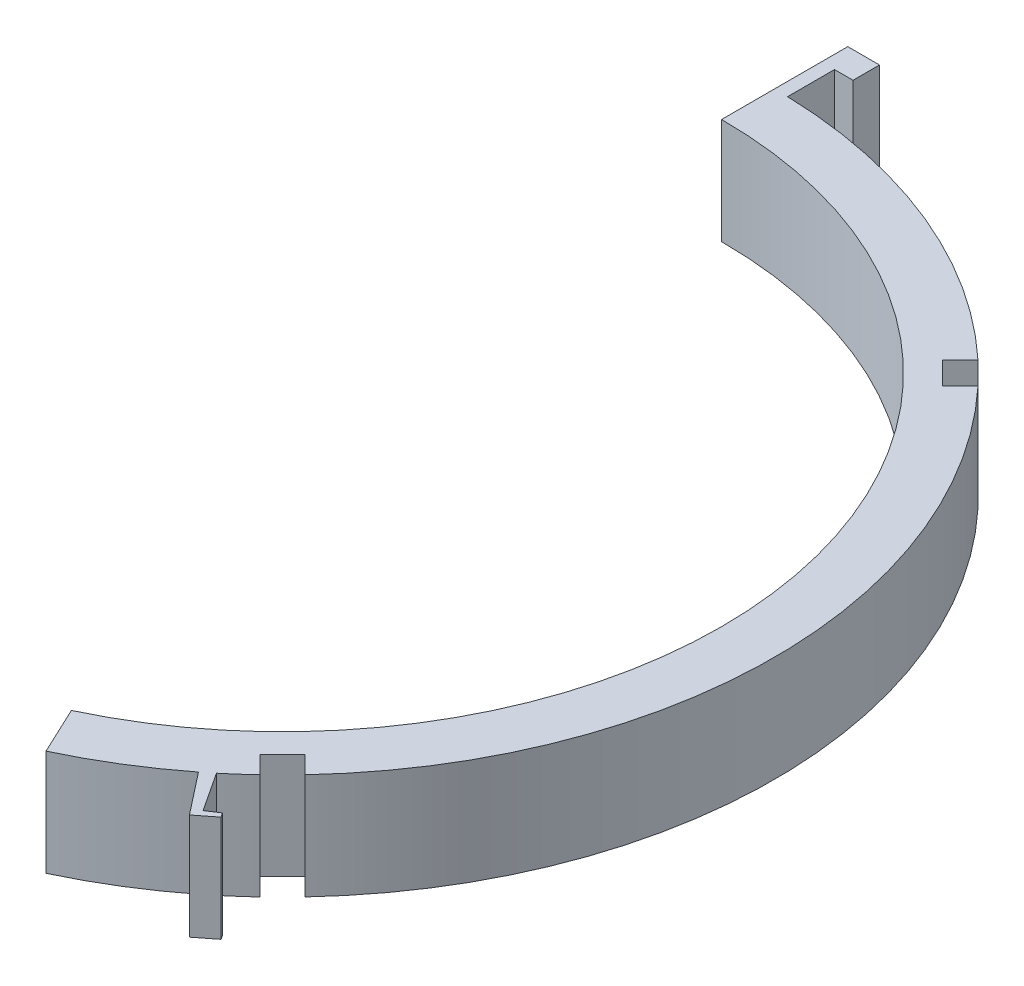
ISO-10303-21;
HEADER;
FILE_DESCRIPTION(('STEP AP214'),'2;1');
FILE_NAME('part.step','',(''),(''),'','','');
FILE_SCHEMA(('AUTOMOTIVE_DESIGN { 1 0 10303 214 1 1 1 1 }'));
ENDSEC;
DATA;
#1=APPLICATION_CONTEXT('core data for automotive mechanical design processes');
#2=APPLICATION_PROTOCOL_DEFINITION('international standard','automotive_design',2000,#1);
#3=PRODUCT_CONTEXT('',#1,'mechanical');
#4=PRODUCT('Part','Part','',(#3));
#5=PRODUCT_RELATED_PRODUCT_CATEGORY('part','',(#4));
#6=PRODUCT_DEFINITION_FORMATION('','',#4);
#7=PRODUCT_DEFINITION_CONTEXT('part definition',#1,'design');
#8=PRODUCT_DEFINITION('design','',#6,#7);
#9=PRODUCT_DEFINITION_SHAPE('','',#8);
#10=(LENGTH_UNIT() NAMED_UNIT(*) SI_UNIT(.MILLI.,.METRE.));
#11=(NAMED_UNIT(*) PLANE_ANGLE_UNIT() SI_UNIT($,.RADIAN.));
#12=(NAMED_UNIT(*) SI_UNIT($,.STERADIAN.) SOLID_ANGLE_UNIT());
#13=UNCERTAINTY_MEASURE_WITH_UNIT(LENGTH_MEASURE(1.E-05),#10,'distance_accuracy_value','');
#14=(GEOMETRIC_REPRESENTATION_CONTEXT(3) GLOBAL_UNCERTAINTY_ASSIGNED_CONTEXT((#13)) GLOBAL_UNIT_ASSIGNED_CONTEXT((#10,
#11,#12)) REPRESENTATION_CONTEXT('',''));
#15=CARTESIAN_POINT('',(0.,0.,0.));
#16=DIRECTION('',(0.,0.,1.));
#17=DIRECTION('',(1.,0.,0.));
#18=AXIS2_PLACEMENT_3D('',#15,#16,#17);
#19=CARTESIAN_POINT('',(0.,10.,0.));
#20=DIRECTION('',(0.,-1.,0.));
#21=DIRECTION('',(0.,0.,-1.));
#22=AXIS2_PLACEMENT_3D('',#19,#20,#21);
#23=CYLINDRICAL_SURFACE('',#22,46.5);
#24=DIRECTION('',(0.,-1.,0.));
#25=VECTOR('',#24,1.);
#26=CARTESIAN_POINT('',(31.8026932785303,10.,33.9240136220896));
#27=LINE('',#26,#25);
#28=CARTESIAN_POINT('',(31.8026932785303,10.,33.9240136220896));
#29=VERTEX_POINT('',#28);
#30=CARTESIAN_POINT('',(31.8026932785303,0.,33.9240136220896));
#31=VERTEX_POINT('',#30);
#32=EDGE_CURVE('E389',#29,#31,#27,.T.);
#33=ORIENTED_EDGE('',*,*,#32,.F.);
#34=CARTESIAN_POINT('',(0.,10.,0.));
#35=DIRECTION('',(0.,1.,0.));
#36=DIRECTION('',(0.,0.,1.));
#37=AXIS2_PLACEMENT_3D('',#34,#35,#36);
#38=CIRCLE('',#37,46.5);
#39=CARTESIAN_POINT('',(29.6237283762294,10.,35.8424987562444));
#40=VERTEX_POINT('',#39);
#41=EDGE_CURVE('E301',#40,#29,#38,.T.);
#42=ORIENTED_EDGE('',*,*,#41,.F.);
#43=DIRECTION('',(0.,-1.,0.));
#44=VECTOR('',#43,1.);
#45=CARTESIAN_POINT('',(29.6237283762294,10.,35.8424987562444));
#46=LINE('',#45,#44);
#47=CARTESIAN_POINT('',(29.6237283762294,0.,35.8424987562444));
#48=VERTEX_POINT('',#47);
#49=EDGE_CURVE('E307',#40,#48,#46,.T.);
#50=ORIENTED_EDGE('',*,*,#49,.T.);
#51=CARTESIAN_POINT('',(0.,0.,0.));
#52=DIRECTION('',(0.,1.,0.));
#53=DIRECTION('',(0.,0.,1.));
#54=AXIS2_PLACEMENT_3D('',#51,#52,#53);
#55=CIRCLE('',#54,46.5);
#56=EDGE_CURVE('E322',#48,#31,#55,.T.);
#57=ORIENTED_EDGE('',*,*,#56,.T.);
#58=EDGE_LOOP('',(#33,#42,#50,#57));
#59=FACE_BOUND('',#58,.T.);
#60=ADVANCED_FACE('F127',(#59),#23,.T.);
#61=CARTESIAN_POINT('',(33.92401362209,10.,31.80269327853));
#62=VERTEX_POINT('',#61);
#63=CARTESIAN_POINT('',(33.9240136220897,10.,-31.8026932785302));
#64=VERTEX_POINT('',#63);
#65=EDGE_CURVE('E506',#62,#64,#38,.T.);
#66=ORIENTED_EDGE('',*,*,#65,.F.);
#67=DIRECTION('',(0.,-1.,0.));
#68=VECTOR('',#67,1.);
#69=CARTESIAN_POINT('',(33.92401362209,10.,31.80269327853));
#70=LINE('',#69,#68);
#71=CARTESIAN_POINT('',(33.92401362209,0.,31.80269327853));
#72=VERTEX_POINT('',#71);
#73=EDGE_CURVE('E392',#62,#72,#70,.T.);
#74=ORIENTED_EDGE('',*,*,#73,.T.);
#75=CARTESIAN_POINT('',(33.9240136220897,0.,-31.8026932785302));
#76=VERTEX_POINT('',#75);
#77=EDGE_CURVE('E562',#72,#76,#55,.T.);
#78=ORIENTED_EDGE('',*,*,#77,.T.);
#79=DIRECTION('',(0.,-1.,0.));
#80=VECTOR('',#79,1.);
#81=CARTESIAN_POINT('',(33.9240136220897,10.,-31.8026932785302));
#82=LINE('',#81,#80);
#83=EDGE_CURVE('E396',#64,#76,#82,.T.);
#84=ORIENTED_EDGE('',*,*,#83,.F.);
#85=EDGE_LOOP('',(#66,#74,#78,#84));
#86=FACE_BOUND('',#85,.T.);
#87=ADVANCED_FACE('F569',(#86),#23,.T.);
#88=CARTESIAN_POINT('',(0.,10.,0.));
#89=DIRECTION('',(0.,1.,0.));
#90=DIRECTION('',(0.,0.,1.));
#91=AXIS2_PLACEMENT_3D('',#88,#89,#90);
#92=PLANE('',#91);
#93=CARTESIAN_POINT('',(19.765588345484,10.,42.0900405958092));
#94=VERTEX_POINT('',#93);
#95=CARTESIAN_POINT('',(28.6811039851293,10.,36.6011512686991));
#96=VERTEX_POINT('',#95);
#97=EDGE_CURVE('E292',#94,#96,#38,.T.);
#98=ORIENTED_EDGE('',*,*,#97,.T.);
#99=DIRECTION('',(0.616797935164072,0.,0.787121532660197));
#100=VECTOR('',#99,1.);
#101=CARTESIAN_POINT('',(0.,10.,0.));
#102=LINE('',#101,#100);
#103=CARTESIAN_POINT('',(31.7650936609497,10.,40.5367589320001));
#104=VERTEX_POINT('',#103);
#105=EDGE_CURVE('E276',#96,#104,#102,.T.);
#106=ORIENTED_EDGE('',*,*,#105,.T.);
#107=DIRECTION('',(0.787121532660193,0.,-0.616797935164077));
#108=VECTOR('',#107,1.);
#109=CARTESIAN_POINT('',(31.7650936609499,10.,40.5367589319999));
#110=LINE('',#109,#108);
#111=CARTESIAN_POINT('',(33.4375623350134,10.,39.2261922888761));
#112=VERTEX_POINT('',#111);
#113=EDGE_CURVE('E287',#104,#112,#110,.T.);
#114=ORIENTED_EDGE('',*,*,#113,.T.);
#115=DIRECTION('',(-0.549115371604578,0.,-0.835746557676169));
#116=VECTOR('',#115,1.);
#117=CARTESIAN_POINT('',(5.35347692341842,10.,-3.5174257592557));
#118=LINE('',#117,#116);
#119=CARTESIAN_POINT('',(33.1629667215609,10.,38.8082612846405));
#120=VERTEX_POINT('',#119);
#121=EDGE_CURVE('E487',#112,#120,#118,.T.);
#122=ORIENTED_EDGE('',*,*,#121,.T.);
#123=DIRECTION('',(-0.835746557676169,0.,0.549115371604578));
#124=VECTOR('',#123,1.);
#125=CARTESIAN_POINT('',(27.8094897981425,10.,42.3256870438962));
#126=LINE('',#125,#124);
#127=CARTESIAN_POINT('',(32.0519582839825,10.,39.5382335536893));
#128=VERTEX_POINT('',#127);
#129=EDGE_CURVE('E469',#120,#128,#126,.T.);
#130=ORIENTED_EDGE('',*,*,#129,.T.);
#131=DIRECTION('',(-0.549115371604578,0.,-0.835746557676169));
#132=VECTOR('',#131,1.);
#133=CARTESIAN_POINT('',(4.24246848584004,10.,-2.78745349020681));
#134=LINE('',#133,#132);
#135=EDGE_CURVE('E288',#128,#40,#134,.T.);
#136=ORIENTED_EDGE('',*,*,#135,.T.);
#137=ORIENTED_EDGE('',*,*,#41,.T.);
#138=DIRECTION('',(0.707106781186463,0.,0.707106781186632));
#139=VECTOR('',#138,1.);
#140=CARTESIAN_POINT('',(30.1327547981866,10.,32.2540751417455));
#141=LINE('',#140,#139);
#142=CARTESIAN_POINT('',(30.1327547981866,10.,32.2540751417455));
#143=VERTEX_POINT('',#142);
#144=EDGE_CURVE('E440',#143,#29,#141,.T.);
#145=ORIENTED_EDGE('',*,*,#144,.F.);
#146=DIRECTION('',(0.707106781186632,0.,-0.707106781186462));
#147=VECTOR('',#146,1.);
#148=CARTESIAN_POINT('',(30.1327547981866,10.,32.2540751417455));
#149=LINE('',#148,#147);
#150=CARTESIAN_POINT('',(32.2540751417465,10.,30.1327547981861));
#151=VERTEX_POINT('',#150);
#152=EDGE_CURVE('E435',#143,#151,#149,.T.);
#153=ORIENTED_EDGE('',*,*,#152,.T.);
#154=DIRECTION('',(0.707106781186463,0.,0.707106781186632));
#155=VECTOR('',#154,1.);
#156=CARTESIAN_POINT('',(32.2540751417465,10.,30.1327547981861));
#157=LINE('',#156,#155);
#158=EDGE_CURVE('E449',#151,#62,#157,.T.);
#159=ORIENTED_EDGE('',*,*,#158,.T.);
#160=ORIENTED_EDGE('',*,*,#65,.T.);
#161=DIRECTION('',(0.707106781186544,0.,-0.707106781186551));
#162=VECTOR('',#161,1.);
#163=CARTESIAN_POINT('',(32.254075141746,10.,-30.1327547981864));
#164=LINE('',#163,#162);
#165=CARTESIAN_POINT('',(32.254075141746,10.,-30.1327547981864));
#166=VERTEX_POINT('',#165);
#167=EDGE_CURVE('E415',#166,#64,#164,.T.);
#168=ORIENTED_EDGE('',*,*,#167,.F.);
#169=DIRECTION('',(-0.707106781186552,0.,-0.707106781186543));
#170=VECTOR('',#169,1.);
#171=CARTESIAN_POINT('',(32.254075141746,10.,-30.1327547981864));
#172=LINE('',#171,#170);
#173=CARTESIAN_POINT('',(30.1327547981863,10.,-32.2540751417461));
#174=VERTEX_POINT('',#173);
#175=EDGE_CURVE('E410',#166,#174,#172,.T.);
#176=ORIENTED_EDGE('',*,*,#175,.T.);
#177=DIRECTION('',(0.707106781186544,0.,-0.707106781186551));
#178=VECTOR('',#177,1.);
#179=CARTESIAN_POINT('',(30.1327547981863,10.,-32.2540751417461));
#180=LINE('',#179,#178);
#181=CARTESIAN_POINT('',(31.8026932785301,10.,-33.9240136220899));
#182=VERTEX_POINT('',#181);
#183=EDGE_CURVE('E424',#174,#182,#180,.T.);
#184=ORIENTED_EDGE('',*,*,#183,.T.);
#185=CARTESIAN_POINT('',(1.25,10.,-46.4831958884068));
#186=VERTEX_POINT('',#185);
#187=EDGE_CURVE('E299',#182,#186,#38,.T.);
#188=ORIENTED_EDGE('',*,*,#187,.T.);
#189=DIRECTION('',(0.,0.,-1.));
#190=VECTOR('',#189,1.);
#191=CARTESIAN_POINT('',(1.25,10.,-46.5));
#192=LINE('',#191,#190);
#193=CARTESIAN_POINT('',(1.25,10.,-50.9212329789273));
#194=VERTEX_POINT('',#193);
#195=EDGE_CURVE('E343',#186,#194,#192,.T.);
#196=ORIENTED_EDGE('',*,*,#195,.T.);
#197=DIRECTION('',(1.,0.,0.));
#198=VECTOR('',#197,1.);
#199=CARTESIAN_POINT('',(0.,10.,-50.9212329789273));
#200=LINE('',#199,#198);
#201=CARTESIAN_POINT('',(3.,10.,-50.9212329789273));
#202=VERTEX_POINT('',#201);
#203=EDGE_CURVE('E358',#194,#202,#200,.T.);
#204=ORIENTED_EDGE('',*,*,#203,.T.);
#205=DIRECTION('',(0.,0.,1.));
#206=VECTOR('',#205,1.);
#207=CARTESIAN_POINT('',(3.,10.,-53.4212329789273));
#208=LINE('',#207,#206);
#209=CARTESIAN_POINT('',(3.,10.,-53.4212329789273));
#210=VERTEX_POINT('',#209);
#211=EDGE_CURVE('E353',#210,#202,#208,.T.);
#212=ORIENTED_EDGE('',*,*,#211,.F.);
#213=DIRECTION('',(1.,0.,0.));
#214=VECTOR('',#213,1.);
#215=CARTESIAN_POINT('',(0.,10.,-53.4212329789273));
#216=LINE('',#215,#214);
#217=CARTESIAN_POINT('',(0.,10.,-53.4212329789273));
#218=VERTEX_POINT('',#217);
#219=EDGE_CURVE('E371',#210,#218,#216,.F.);
#220=ORIENTED_EDGE('',*,*,#219,.T.);
#221=DIRECTION('',(0.,0.,-1.));
#222=VECTOR('',#221,1.);
#223=CARTESIAN_POINT('',(0.,10.,0.));
#224=LINE('',#223,#222);
#225=CARTESIAN_POINT('',(0.,10.,-41.5));
#226=VERTEX_POINT('',#225);
#227=EDGE_CURVE('E382',#226,#218,#224,.T.);
#228=ORIENTED_EDGE('',*,*,#227,.F.);
#229=CARTESIAN_POINT('',(0.,10.,0.));
#230=DIRECTION('',(0.,1.,0.));
#231=DIRECTION('',(0.,0.,1.));
#232=AXIS2_PLACEMENT_3D('',#229,#230,#231);
#233=CIRCLE('',#232,41.5);
#234=CARTESIAN_POINT('',(17.6402562653244,10.,37.5642297790555));
#235=VERTEX_POINT('',#234);
#236=EDGE_CURVE('E317',#235,#226,#233,.T.);
#237=ORIENTED_EDGE('',*,*,#236,.F.);
#238=DIRECTION('',(-0.425066416031914,0.,-0.905162163350736));
#239=VECTOR('',#238,1.);
#240=CARTESIAN_POINT('',(0.,10.,0.));
#241=LINE('',#240,#239);
#242=EDGE_CURVE('E296',#94,#235,#241,.T.);
#243=ORIENTED_EDGE('',*,*,#242,.F.);
#244=EDGE_LOOP('',(#98,#106,#114,#122,#130,#136,#137,#145,#153,#159,#160,#168,#176,#184,#188,
#196,#204,#212,#220,#228,#237,#243));
#245=FACE_BOUND('',#244,.T.);
#246=ADVANCED_FACE('F293',(#245),#92,.T.);
#247=CARTESIAN_POINT('',(0.,0.,0.));
#248=DIRECTION('',(0.,1.,0.));
#249=DIRECTION('',(0.,0.,1.));
#250=AXIS2_PLACEMENT_3D('',#247,#248,#249);
#251=PLANE('',#250);
#252=DIRECTION('',(0.616797935164072,0.,0.787121532660197));
#253=VECTOR('',#252,1.);
#254=CARTESIAN_POINT('',(0.,0.,0.));
#255=LINE('',#254,#253);
#256=CARTESIAN_POINT('',(28.6811039851293,0.,36.6011512686991));
#257=VERTEX_POINT('',#256);
#258=CARTESIAN_POINT('',(31.7650936609497,0.,40.5367589320001));
#259=VERTEX_POINT('',#258);
#260=EDGE_CURVE('E479',#257,#259,#255,.T.);
#261=ORIENTED_EDGE('',*,*,#260,.F.);
#262=CARTESIAN_POINT('',(19.765588345484,0.,42.0900405958092));
#263=VERTEX_POINT('',#262);
#264=EDGE_CURVE('E305',#263,#257,#55,.T.);
#265=ORIENTED_EDGE('',*,*,#264,.F.);
#266=DIRECTION('',(-0.425066416031914,0.,-0.905162163350736));
#267=VECTOR('',#266,1.);
#268=CARTESIAN_POINT('',(0.,0.,0.));
#269=LINE('',#268,#267);
#270=CARTESIAN_POINT('',(17.6402562653244,0.,37.5642297790555));
#271=VERTEX_POINT('',#270);
#272=EDGE_CURVE('E326',#263,#271,#269,.T.);
#273=ORIENTED_EDGE('',*,*,#272,.T.);
#274=CARTESIAN_POINT('',(0.,0.,0.));
#275=DIRECTION('',(0.,1.,0.));
#276=DIRECTION('',(0.,0.,1.));
#277=AXIS2_PLACEMENT_3D('',#274,#275,#276);
#278=CIRCLE('',#277,41.5);
#279=CARTESIAN_POINT('',(0.,0.,-41.5));
#280=VERTEX_POINT('',#279);
#281=EDGE_CURVE('E318',#271,#280,#278,.T.);
#282=ORIENTED_EDGE('',*,*,#281,.T.);
#283=DIRECTION('',(0.,0.,-1.));
#284=VECTOR('',#283,1.);
#285=CARTESIAN_POINT('',(0.,0.,0.));
#286=LINE('',#285,#284);
#287=CARTESIAN_POINT('',(0.,0.,-53.4212329789273));
#288=VERTEX_POINT('',#287);
#289=EDGE_CURVE('E385',#280,#288,#286,.T.);
#290=ORIENTED_EDGE('',*,*,#289,.T.);
#291=DIRECTION('',(1.,0.,0.));
#292=VECTOR('',#291,1.);
#293=CARTESIAN_POINT('',(0.,0.,-53.4212329789273));
#294=LINE('',#293,#292);
#295=CARTESIAN_POINT('',(3.,0.,-53.4212329789273));
#296=VERTEX_POINT('',#295);
#297=EDGE_CURVE('E348',#296,#288,#294,.F.);
#298=ORIENTED_EDGE('',*,*,#297,.F.);
#299=DIRECTION('',(0.,0.,1.));
#300=VECTOR('',#299,1.);
#301=CARTESIAN_POINT('',(3.,0.,-53.4212329789273));
#302=LINE('',#301,#300);
#303=CARTESIAN_POINT('',(3.,0.,-50.9212329789273));
#304=VERTEX_POINT('',#303);
#305=EDGE_CURVE('E354',#296,#304,#302,.T.);
#306=ORIENTED_EDGE('',*,*,#305,.T.);
#307=DIRECTION('',(1.,0.,0.));
#308=VECTOR('',#307,1.);
#309=CARTESIAN_POINT('',(0.,0.,-50.9212329789273));
#310=LINE('',#309,#308);
#311=CARTESIAN_POINT('',(1.25,0.,-50.9212329789273));
#312=VERTEX_POINT('',#311);
#313=EDGE_CURVE('E359',#312,#304,#310,.T.);
#314=ORIENTED_EDGE('',*,*,#313,.F.);
#315=DIRECTION('',(0.,0.,-1.));
#316=VECTOR('',#315,1.);
#317=CARTESIAN_POINT('',(1.25,0.,-41.5));
#318=LINE('',#317,#316);
#319=CARTESIAN_POINT('',(1.25,0.,-46.4831958884068));
#320=VERTEX_POINT('',#319);
#321=EDGE_CURVE('E375',#320,#312,#318,.T.);
#322=ORIENTED_EDGE('',*,*,#321,.F.);
#323=CARTESIAN_POINT('',(31.8026932785301,0.,-33.9240136220899));
#324=VERTEX_POINT('',#323);
#325=EDGE_CURVE('E325',#324,#320,#55,.T.);
#326=ORIENTED_EDGE('',*,*,#325,.F.);
#327=DIRECTION('',(0.707106781186544,0.,-0.707106781186551));
#328=VECTOR('',#327,1.);
#329=CARTESIAN_POINT('',(30.1327547981863,0.,-32.2540751417461));
#330=LINE('',#329,#328);
#331=CARTESIAN_POINT('',(30.1327547981863,0.,-32.2540751417461));
#332=VERTEX_POINT('',#331);
#333=EDGE_CURVE('E416',#332,#324,#330,.T.);
#334=ORIENTED_EDGE('',*,*,#333,.F.);
#335=DIRECTION('',(-0.707106781186552,0.,-0.707106781186543));
#336=VECTOR('',#335,1.);
#337=CARTESIAN_POINT('',(32.254075141746,0.,-30.1327547981864));
#338=LINE('',#337,#336);
#339=CARTESIAN_POINT('',(32.254075141746,0.,-30.1327547981864));
#340=VERTEX_POINT('',#339);
#341=EDGE_CURVE('E411',#340,#332,#338,.T.);
#342=ORIENTED_EDGE('',*,*,#341,.F.);
#343=DIRECTION('',(0.707106781186544,0.,-0.707106781186551));
#344=VECTOR('',#343,1.);
#345=CARTESIAN_POINT('',(32.254075141746,0.,-30.1327547981864));
#346=LINE('',#345,#344);
#347=EDGE_CURVE('E151',#340,#76,#346,.T.);
#348=ORIENTED_EDGE('',*,*,#347,.T.);
#349=ORIENTED_EDGE('',*,*,#77,.F.);
#350=DIRECTION('',(0.707106781186463,0.,0.707106781186632));
#351=VECTOR('',#350,1.);
#352=CARTESIAN_POINT('',(32.2540751417465,0.,30.1327547981861));
#353=LINE('',#352,#351);
#354=CARTESIAN_POINT('',(32.2540751417465,0.,30.1327547981861));
#355=VERTEX_POINT('',#354);
#356=EDGE_CURVE('E441',#355,#72,#353,.T.);
#357=ORIENTED_EDGE('',*,*,#356,.F.);
#358=DIRECTION('',(0.707106781186632,0.,-0.707106781186462));
#359=VECTOR('',#358,1.);
#360=CARTESIAN_POINT('',(30.1327547981866,0.,32.2540751417455));
#361=LINE('',#360,#359);
#362=CARTESIAN_POINT('',(30.1327547981866,0.,32.2540751417455));
#363=VERTEX_POINT('',#362);
#364=EDGE_CURVE('E436',#363,#355,#361,.T.);
#365=ORIENTED_EDGE('',*,*,#364,.F.);
#366=DIRECTION('',(0.707106781186463,0.,0.707106781186632));
#367=VECTOR('',#366,1.);
#368=CARTESIAN_POINT('',(30.1327547981866,0.,32.2540751417455));
#369=LINE('',#368,#367);
#370=EDGE_CURVE('E143',#363,#31,#369,.T.);
#371=ORIENTED_EDGE('',*,*,#370,.T.);
#372=ORIENTED_EDGE('',*,*,#56,.F.);
#373=DIRECTION('',(-0.549115371604578,0.,-0.835746557676169));
#374=VECTOR('',#373,1.);
#375=CARTESIAN_POINT('',(4.24246848584004,0.,-2.78745349020681));
#376=LINE('',#375,#374);
#377=CARTESIAN_POINT('',(32.0519582839825,0.,39.5382335536893));
#378=VERTEX_POINT('',#377);
#379=EDGE_CURVE('E482',#378,#48,#376,.T.);
#380=ORIENTED_EDGE('',*,*,#379,.F.);
#381=DIRECTION('',(-0.835746557676169,0.,0.549115371604578));
#382=VECTOR('',#381,1.);
#383=CARTESIAN_POINT('',(27.8094897981425,0.,42.3256870438962));
#384=LINE('',#383,#382);
#385=CARTESIAN_POINT('',(33.1629667215609,0.,38.8082612846405));
#386=VERTEX_POINT('',#385);
#387=EDGE_CURVE('E470',#386,#378,#384,.T.);
#388=ORIENTED_EDGE('',*,*,#387,.F.);
#389=DIRECTION('',(-0.549115371604578,0.,-0.835746557676169));
#390=VECTOR('',#389,1.);
#391=CARTESIAN_POINT('',(5.35347692341842,0.,-3.5174257592557));
#392=LINE('',#391,#390);
#393=CARTESIAN_POINT('',(33.4375623350134,0.,39.2261922888761));
#394=VERTEX_POINT('',#393);
#395=EDGE_CURVE('E473',#394,#386,#392,.T.);
#396=ORIENTED_EDGE('',*,*,#395,.F.);
#397=DIRECTION('',(0.787121532660193,0.,-0.616797935164077));
#398=VECTOR('',#397,1.);
#399=CARTESIAN_POINT('',(31.7650936609499,0.,40.5367589319999));
#400=LINE('',#399,#398);
#401=EDGE_CURVE('E476',#259,#394,#400,.T.);
#402=ORIENTED_EDGE('',*,*,#401,.F.);
#403=EDGE_LOOP('',(#261,#265,#273,#282,#290,#298,#306,#314,#322,#326,#334,#342,#348,#349,#357,
#365,#371,#372,#380,#388,#396,#402));
#404=FACE_BOUND('',#403,.T.);
#405=ADVANCED_FACE('F540',(#404),#251,.F.);
#406=CARTESIAN_POINT('',(0.,0.,0.));
#407=DIRECTION('',(1.,0.,0.));
#408=DIRECTION('',(0.,0.,-1.));
#409=AXIS2_PLACEMENT_3D('',#406,#407,#408);
#410=PLANE('',#409);
#411=ORIENTED_EDGE('',*,*,#289,.F.);
#412=DIRECTION('',(0.,-1.,0.));
#413=VECTOR('',#412,1.);
#414=CARTESIAN_POINT('',(0.,10.,-41.5));
#415=LINE('',#414,#413);
#416=EDGE_CURVE('E362',#280,#226,#415,.F.);
#417=ORIENTED_EDGE('',*,*,#416,.T.);
#418=ORIENTED_EDGE('',*,*,#227,.T.);
#419=DIRECTION('',(0.,1.,0.));
#420=VECTOR('',#419,1.);
#421=CARTESIAN_POINT('',(0.,10.,-53.4212329789273));
#422=LINE('',#421,#420);
#423=EDGE_CURVE('E13',#288,#218,#422,.T.);
#424=ORIENTED_EDGE('',*,*,#423,.F.);
#425=EDGE_LOOP('',(#411,#417,#418,#424));
#426=FACE_BOUND('',#425,.T.);
#427=ADVANCED_FACE('F537',(#426),#410,.F.);
#428=ORIENTED_EDGE('',*,*,#187,.F.);
#429=DIRECTION('',(0.,-1.,0.));
#430=VECTOR('',#429,1.);
#431=CARTESIAN_POINT('',(31.8026932785301,10.,-33.9240136220899));
#432=LINE('',#431,#430);
#433=EDGE_CURVE('E399',#182,#324,#432,.T.);
#434=ORIENTED_EDGE('',*,*,#433,.T.);
#435=ORIENTED_EDGE('',*,*,#325,.T.);
#436=DIRECTION('',(0.,-1.,0.));
#437=VECTOR('',#436,1.);
#438=CARTESIAN_POINT('',(1.25,10.,-46.4831958884068));
#439=LINE('',#438,#437);
#440=EDGE_CURVE('E330',#186,#320,#439,.T.);
#441=ORIENTED_EDGE('',*,*,#440,.F.);
#442=EDGE_LOOP('',(#428,#434,#435,#441));
#443=FACE_BOUND('',#442,.T.);
#444=ADVANCED_FACE('F518',(#443),#23,.T.);
#445=CARTESIAN_POINT('',(0.,10.,0.));
#446=DIRECTION('',(-0.905162163350736,0.,0.425066416031914));
#447=DIRECTION('',(0.425066416031914,0.,0.905162163350736));
#448=AXIS2_PLACEMENT_3D('',#445,#446,#447);
#449=PLANE('',#448);
#450=ORIENTED_EDGE('',*,*,#272,.F.);
#451=DIRECTION('',(0.,-1.,0.));
#452=VECTOR('',#451,1.);
#453=CARTESIAN_POINT('',(19.765588345484,10.,42.0900405958092));
#454=LINE('',#453,#452);
#455=EDGE_CURVE('E136',#94,#263,#454,.T.);
#456=ORIENTED_EDGE('',*,*,#455,.F.);
#457=ORIENTED_EDGE('',*,*,#242,.T.);
#458=DIRECTION('',(0.,-1.,0.));
#459=VECTOR('',#458,1.);
#460=CARTESIAN_POINT('',(17.6402562653244,10.,37.5642297790555));
#461=LINE('',#460,#459);
#462=EDGE_CURVE('E312',#235,#271,#461,.T.);
#463=ORIENTED_EDGE('',*,*,#462,.T.);
#464=EDGE_LOOP('',(#450,#456,#457,#463));
#465=FACE_BOUND('',#464,.T.);
#466=ADVANCED_FACE('F129',(#465),#449,.T.);
#467=ORIENTED_EDGE('',*,*,#264,.T.);
#468=DIRECTION('',(0.,-1.,0.));
#469=VECTOR('',#468,1.);
#470=CARTESIAN_POINT('',(28.6811039851293,10.,36.6011512686991));
#471=LINE('',#470,#469);
#472=EDGE_CURVE('E280',#96,#257,#471,.T.);
#473=ORIENTED_EDGE('',*,*,#472,.F.);
#474=ORIENTED_EDGE('',*,*,#97,.F.);
#475=ORIENTED_EDGE('',*,*,#455,.T.);
#476=EDGE_LOOP('',(#467,#473,#474,#475));
#477=FACE_BOUND('',#476,.T.);
#478=ADVANCED_FACE('F303',(#477),#23,.T.);
#479=CARTESIAN_POINT('',(0.,10.,0.));
#480=DIRECTION('',(0.,-1.,0.));
#481=DIRECTION('',(0.,0.,-1.));
#482=AXIS2_PLACEMENT_3D('',#479,#480,#481);
#483=CYLINDRICAL_SURFACE('',#482,41.5);
#484=ORIENTED_EDGE('',*,*,#416,.F.);
#485=ORIENTED_EDGE('',*,*,#281,.F.);
#486=ORIENTED_EDGE('',*,*,#462,.F.);
#487=ORIENTED_EDGE('',*,*,#236,.T.);
#488=EDGE_LOOP('',(#484,#485,#486,#487));
#489=FACE_BOUND('',#488,.T.);
#490=ADVANCED_FACE('F544',(#489),#483,.F.);
#491=CARTESIAN_POINT('',(1.25,10.,-41.5));
#492=DIRECTION('',(-1.,0.,0.));
#493=DIRECTION('',(0.,0.,1.));
#494=AXIS2_PLACEMENT_3D('',#491,#492,#493);
#495=PLANE('',#494);
#496=ORIENTED_EDGE('',*,*,#195,.F.);
#497=ORIENTED_EDGE('',*,*,#440,.T.);
#498=ORIENTED_EDGE('',*,*,#321,.T.);
#499=DIRECTION('',(0.,-1.,0.));
#500=VECTOR('',#499,1.);
#501=CARTESIAN_POINT('',(1.25,10.,-50.9212329789273));
#502=LINE('',#501,#500);
#503=EDGE_CURVE('E339',#194,#312,#502,.T.);
#504=ORIENTED_EDGE('',*,*,#503,.F.);
#505=EDGE_LOOP('',(#496,#497,#498,#504));
#506=FACE_BOUND('',#505,.T.);
#507=ADVANCED_FACE('F522',(#506),#495,.F.);
#508=CARTESIAN_POINT('',(0.,10.,-53.4212329789273));
#509=DIRECTION('',(0.,0.,1.));
#510=DIRECTION('',(1.,0.,0.));
#511=AXIS2_PLACEMENT_3D('',#508,#509,#510);
#512=PLANE('',#511);
#513=ORIENTED_EDGE('',*,*,#297,.T.);
#514=ORIENTED_EDGE('',*,*,#423,.T.);
#515=ORIENTED_EDGE('',*,*,#219,.F.);
#516=DIRECTION('',(0.,-1.,0.));
#517=VECTOR('',#516,1.);
#518=CARTESIAN_POINT('',(3.,10.,-53.4212329789273));
#519=LINE('',#518,#517);
#520=EDGE_CURVE('E349',#210,#296,#519,.T.);
#521=ORIENTED_EDGE('',*,*,#520,.T.);
#522=EDGE_LOOP('',(#513,#514,#515,#521));
#523=FACE_BOUND('',#522,.T.);
#524=ADVANCED_FACE('F535',(#523),#512,.F.);
#525=CARTESIAN_POINT('',(0.,10.,-50.9212329789273));
#526=DIRECTION('',(0.,0.,-1.));
#527=DIRECTION('',(-1.,0.,0.));
#528=AXIS2_PLACEMENT_3D('',#525,#526,#527);
#529=PLANE('',#528);
#530=ORIENTED_EDGE('',*,*,#203,.F.);
#531=ORIENTED_EDGE('',*,*,#503,.T.);
#532=ORIENTED_EDGE('',*,*,#313,.T.);
#533=DIRECTION('',(0.,-1.,0.));
#534=VECTOR('',#533,1.);
#535=CARTESIAN_POINT('',(3.,10.,-50.9212329789273));
#536=LINE('',#535,#534);
#537=EDGE_CURVE('E344',#202,#304,#536,.T.);
#538=ORIENTED_EDGE('',*,*,#537,.F.);
#539=EDGE_LOOP('',(#530,#531,#532,#538));
#540=FACE_BOUND('',#539,.T.);
#541=ADVANCED_FACE('F527',(#540),#529,.F.);
#542=CARTESIAN_POINT('',(3.,10.,-53.4212329789273));
#543=DIRECTION('',(1.,0.,0.));
#544=DIRECTION('',(0.,0.,-1.));
#545=AXIS2_PLACEMENT_3D('',#542,#543,#544);
#546=PLANE('',#545);
#547=ORIENTED_EDGE('',*,*,#305,.F.);
#548=ORIENTED_EDGE('',*,*,#520,.F.);
#549=ORIENTED_EDGE('',*,*,#211,.T.);
#550=ORIENTED_EDGE('',*,*,#537,.T.);
#551=EDGE_LOOP('',(#547,#548,#549,#550));
#552=FACE_BOUND('',#551,.T.);
#553=ADVANCED_FACE('F533',(#552),#546,.T.);
#554=CARTESIAN_POINT('',(32.254075141746,10.,-30.1327547981864));
#555=DIRECTION('',(-0.707106781186551,0.,-0.707106781186544));
#556=DIRECTION('',(-0.707106781186544,0.,0.707106781186551));
#557=AXIS2_PLACEMENT_3D('',#554,#555,#556);
#558=PLANE('',#557);
#559=ORIENTED_EDGE('',*,*,#83,.T.);
#560=ORIENTED_EDGE('',*,*,#347,.F.);
#561=DIRECTION('',(0.,-1.,0.));
#562=VECTOR('',#561,1.);
#563=CARTESIAN_POINT('',(32.254075141746,10.,-30.1327547981864));
#564=LINE('',#563,#562);
#565=EDGE_CURVE('E407',#166,#340,#564,.T.);
#566=ORIENTED_EDGE('',*,*,#565,.F.);
#567=ORIENTED_EDGE('',*,*,#167,.T.);
#568=EDGE_LOOP('',(#559,#560,#566,#567));
#569=FACE_BOUND('',#568,.T.);
#570=ADVANCED_FACE('F576',(#569),#558,.T.);
#571=CARTESIAN_POINT('',(30.1327547981863,10.,-32.2540751417461));
#572=DIRECTION('',(-0.707106781186551,0.,-0.707106781186544));
#573=DIRECTION('',(-0.707106781186544,0.,0.707106781186551));
#574=AXIS2_PLACEMENT_3D('',#571,#572,#573);
#575=PLANE('',#574);
#576=ORIENTED_EDGE('',*,*,#183,.F.);
#577=DIRECTION('',(0.,-1.,0.));
#578=VECTOR('',#577,1.);
#579=CARTESIAN_POINT('',(30.1327547981863,10.,-32.2540751417461));
#580=LINE('',#579,#578);
#581=EDGE_CURVE('E404',#174,#332,#580,.T.);
#582=ORIENTED_EDGE('',*,*,#581,.T.);
#583=ORIENTED_EDGE('',*,*,#333,.T.);
#584=ORIENTED_EDGE('',*,*,#433,.F.);
#585=EDGE_LOOP('',(#576,#582,#583,#584));
#586=FACE_BOUND('',#585,.T.);
#587=ADVANCED_FACE('F578',(#586),#575,.F.);
#588=CARTESIAN_POINT('',(32.254075141746,10.,-30.1327547981864));
#589=DIRECTION('',(-0.707106781186543,0.,0.707106781186552));
#590=DIRECTION('',(0.707106781186552,0.,0.707106781186543));
#591=AXIS2_PLACEMENT_3D('',#588,#589,#590);
#592=PLANE('',#591);
#593=ORIENTED_EDGE('',*,*,#341,.T.);
#594=ORIENTED_EDGE('',*,*,#581,.F.);
#595=ORIENTED_EDGE('',*,*,#175,.F.);
#596=ORIENTED_EDGE('',*,*,#565,.T.);
#597=EDGE_LOOP('',(#593,#594,#595,#596));
#598=FACE_BOUND('',#597,.T.);
#599=ADVANCED_FACE('F574',(#598),#592,.F.);
#600=CARTESIAN_POINT('',(30.1327547981866,10.,32.2540751417455));
#601=DIRECTION('',(0.707106781186632,0.,-0.707106781186463));
#602=DIRECTION('',(-0.707106781186463,0.,-0.707106781186632));
#603=AXIS2_PLACEMENT_3D('',#600,#601,#602);
#604=PLANE('',#603);
#605=ORIENTED_EDGE('',*,*,#32,.T.);
#606=ORIENTED_EDGE('',*,*,#370,.F.);
#607=DIRECTION('',(0.,-1.,0.));
#608=VECTOR('',#607,1.);
#609=CARTESIAN_POINT('',(30.1327547981866,10.,32.2540751417455));
#610=LINE('',#609,#608);
#611=EDGE_CURVE('E432',#143,#363,#610,.T.);
#612=ORIENTED_EDGE('',*,*,#611,.F.);
#613=ORIENTED_EDGE('',*,*,#144,.T.);
#614=EDGE_LOOP('',(#605,#606,#612,#613));
#615=FACE_BOUND('',#614,.T.);
#616=ADVANCED_FACE('F687',(#615),#604,.T.);
#617=CARTESIAN_POINT('',(32.2540751417465,10.,30.1327547981861));
#618=DIRECTION('',(0.707106781186632,0.,-0.707106781186463));
#619=DIRECTION('',(-0.707106781186463,0.,-0.707106781186632));
#620=AXIS2_PLACEMENT_3D('',#617,#618,#619);
#621=PLANE('',#620);
#622=ORIENTED_EDGE('',*,*,#158,.F.);
#623=DIRECTION('',(0.,-1.,0.));
#624=VECTOR('',#623,1.);
#625=CARTESIAN_POINT('',(32.2540751417465,10.,30.1327547981861));
#626=LINE('',#625,#624);
#627=EDGE_CURVE('E403',#151,#355,#626,.T.);
#628=ORIENTED_EDGE('',*,*,#627,.T.);
#629=ORIENTED_EDGE('',*,*,#356,.T.);
#630=ORIENTED_EDGE('',*,*,#73,.F.);
#631=EDGE_LOOP('',(#622,#628,#629,#630));
#632=FACE_BOUND('',#631,.T.);
#633=ADVANCED_FACE('F696',(#632),#621,.F.);
#634=CARTESIAN_POINT('',(30.1327547981866,10.,32.2540751417455));
#635=DIRECTION('',(-0.707106781186463,0.,-0.707106781186633));
#636=DIRECTION('',(-0.707106781186633,0.,0.707106781186463));
#637=AXIS2_PLACEMENT_3D('',#634,#635,#636);
#638=PLANE('',#637);
#639=ORIENTED_EDGE('',*,*,#364,.T.);
#640=ORIENTED_EDGE('',*,*,#627,.F.);
#641=ORIENTED_EDGE('',*,*,#152,.F.);
#642=ORIENTED_EDGE('',*,*,#611,.T.);
#643=EDGE_LOOP('',(#639,#640,#641,#642));
#644=FACE_BOUND('',#643,.T.);
#645=ADVANCED_FACE('F705',(#644),#638,.F.);
#646=CARTESIAN_POINT('',(4.24246848584004,10.,-2.78745349020681));
#647=DIRECTION('',(-0.835746557676169,0.,0.549115371604578));
#648=DIRECTION('',(0.549115371604578,0.,0.835746557676169));
#649=AXIS2_PLACEMENT_3D('',#646,#647,#648);
#650=PLANE('',#649);
#651=ORIENTED_EDGE('',*,*,#379,.T.);
#652=ORIENTED_EDGE('',*,*,#49,.F.);
#653=ORIENTED_EDGE('',*,*,#135,.F.);
#654=DIRECTION('',(0.,-1.,0.));
#655=VECTOR('',#654,1.);
#656=CARTESIAN_POINT('',(32.0519582839825,10.,39.5382335536893));
#657=LINE('',#656,#655);
#658=EDGE_CURVE('E465',#128,#378,#657,.T.);
#659=ORIENTED_EDGE('',*,*,#658,.T.);
#660=EDGE_LOOP('',(#651,#652,#653,#659));
#661=FACE_BOUND('',#660,.T.);
#662=ADVANCED_FACE('F559',(#661),#650,.F.);
#663=CARTESIAN_POINT('',(0.,10.,0.));
#664=DIRECTION('',(0.787121532660197,0.,-0.616797935164072));
#665=DIRECTION('',(-0.616797935164072,0.,-0.787121532660197));
#666=AXIS2_PLACEMENT_3D('',#663,#664,#665);
#667=PLANE('',#666);
#668=ORIENTED_EDGE('',*,*,#260,.T.);
#669=DIRECTION('',(0.,-1.,0.));
#670=VECTOR('',#669,1.);
#671=CARTESIAN_POINT('',(31.7650936609497,10.,40.5367589320001));
#672=LINE('',#671,#670);
#673=EDGE_CURVE('E283',#104,#259,#672,.T.);
#674=ORIENTED_EDGE('',*,*,#673,.F.);
#675=ORIENTED_EDGE('',*,*,#105,.F.);
#676=ORIENTED_EDGE('',*,*,#472,.T.);
#677=EDGE_LOOP('',(#668,#674,#675,#676));
#678=FACE_BOUND('',#677,.T.);
#679=ADVANCED_FACE('F278',(#678),#667,.F.);
#680=CARTESIAN_POINT('',(31.7650936609499,10.,40.5367589319999));
#681=DIRECTION('',(-0.616797935164076,0.,-0.787121532660193));
#682=DIRECTION('',(-0.787121532660193,0.,0.616797935164076));
#683=AXIS2_PLACEMENT_3D('',#680,#681,#682);
#684=PLANE('',#683);
#685=ORIENTED_EDGE('',*,*,#401,.T.);
#686=DIRECTION('',(0.,-1.,0.));
#687=VECTOR('',#686,1.);
#688=CARTESIAN_POINT('',(33.4375623350134,10.,39.2261922888761));
#689=LINE('',#688,#687);
#690=EDGE_CURVE('E457',#112,#394,#689,.T.);
#691=ORIENTED_EDGE('',*,*,#690,.F.);
#692=ORIENTED_EDGE('',*,*,#113,.F.);
#693=ORIENTED_EDGE('',*,*,#673,.T.);
#694=EDGE_LOOP('',(#685,#691,#692,#693));
#695=FACE_BOUND('',#694,.T.);
#696=ADVANCED_FACE('F549',(#695),#684,.F.);
#697=CARTESIAN_POINT('',(5.35347692341842,10.,-3.5174257592557));
#698=DIRECTION('',(-0.835746557676169,0.,0.549115371604578));
#699=DIRECTION('',(0.549115371604578,0.,0.835746557676169));
#700=AXIS2_PLACEMENT_3D('',#697,#698,#699);
#701=PLANE('',#700);
#702=ORIENTED_EDGE('',*,*,#395,.T.);
#703=DIRECTION('',(0.,-1.,0.));
#704=VECTOR('',#703,1.);
#705=CARTESIAN_POINT('',(33.1629667215609,10.,38.8082612846405));
#706=LINE('',#705,#704);
#707=EDGE_CURVE('E461',#120,#386,#706,.T.);
#708=ORIENTED_EDGE('',*,*,#707,.F.);
#709=ORIENTED_EDGE('',*,*,#121,.F.);
#710=ORIENTED_EDGE('',*,*,#690,.T.);
#711=EDGE_LOOP('',(#702,#708,#709,#710));
#712=FACE_BOUND('',#711,.T.);
#713=ADVANCED_FACE('F554',(#712),#701,.F.);
#714=CARTESIAN_POINT('',(27.8094897981425,10.,42.3256870438962));
#715=DIRECTION('',(0.549115371604578,0.,0.835746557676169));
#716=DIRECTION('',(0.835746557676169,0.,-0.549115371604578));
#717=AXIS2_PLACEMENT_3D('',#714,#715,#716);
#718=PLANE('',#717);
#719=ORIENTED_EDGE('',*,*,#387,.T.);
#720=ORIENTED_EDGE('',*,*,#658,.F.);
#721=ORIENTED_EDGE('',*,*,#129,.F.);
#722=ORIENTED_EDGE('',*,*,#707,.T.);
#723=EDGE_LOOP('',(#719,#720,#721,#722));
#724=FACE_BOUND('',#723,.T.);
#725=ADVANCED_FACE('F557',(#724),#718,.F.);
#726=CLOSED_SHELL('',(#60,#87,#246,#405,#427,#444,#466,#478,#490,#507,#524,#541,#553,#570,#587,
#599,#616,#633,#645,#662,#679,#696,#713,#725));
#727=MANIFOLD_SOLID_BREP('B2',#726);
#728=ADVANCED_BREP_SHAPE_REPRESENTATION('',(#18,#727),#14);
#729=SHAPE_DEFINITION_REPRESENTATION(#9,#728);
ENDSEC;
END-ISO-10303-21;
